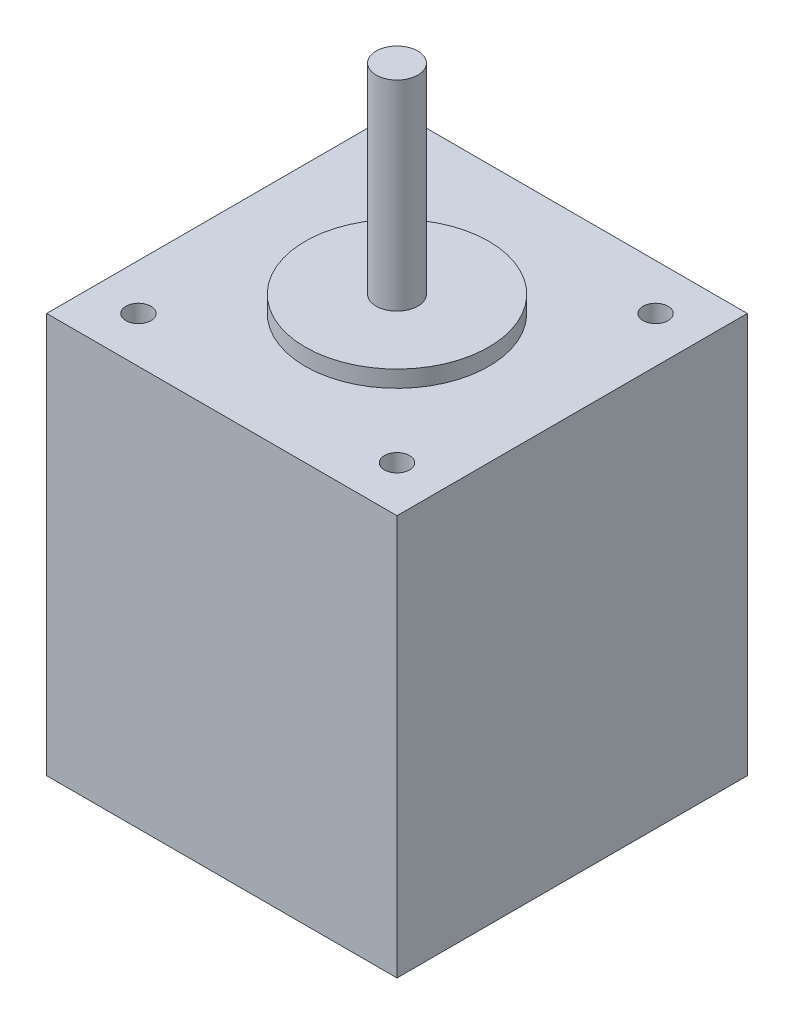
ISO-10303-21;
HEADER;
FILE_DESCRIPTION(('STEP AP214'),'2;1');
FILE_NAME('part.step','',(''),(''),'','','');
FILE_SCHEMA(('AUTOMOTIVE_DESIGN { 1 0 10303 214 1 1 1 1 }'));
ENDSEC;
DATA;
#1=APPLICATION_CONTEXT('core data for automotive mechanical design processes');
#2=APPLICATION_PROTOCOL_DEFINITION('international standard','automotive_design',2000,#1);
#3=PRODUCT_CONTEXT('',#1,'mechanical');
#4=PRODUCT('Part','Part','',(#3));
#5=PRODUCT_RELATED_PRODUCT_CATEGORY('part','',(#4));
#6=PRODUCT_DEFINITION_FORMATION('','',#4);
#7=PRODUCT_DEFINITION_CONTEXT('part definition',#1,'design');
#8=PRODUCT_DEFINITION('design','',#6,#7);
#9=PRODUCT_DEFINITION_SHAPE('','',#8);
#10=(LENGTH_UNIT() NAMED_UNIT(*) SI_UNIT(.MILLI.,.METRE.));
#11=(NAMED_UNIT(*) PLANE_ANGLE_UNIT() SI_UNIT($,.RADIAN.));
#12=(NAMED_UNIT(*) SI_UNIT($,.STERADIAN.) SOLID_ANGLE_UNIT());
#13=UNCERTAINTY_MEASURE_WITH_UNIT(LENGTH_MEASURE(1.E-05),#10,'distance_accuracy_value','');
#14=(GEOMETRIC_REPRESENTATION_CONTEXT(3) GLOBAL_UNCERTAINTY_ASSIGNED_CONTEXT((#13)) GLOBAL_UNIT_ASSIGNED_CONTEXT((#10,
#11,#12)) REPRESENTATION_CONTEXT('',''));
#15=CARTESIAN_POINT('',(0.,0.,0.));
#16=DIRECTION('',(0.,0.,1.));
#17=DIRECTION('',(1.,0.,0.));
#18=AXIS2_PLACEMENT_3D('',#15,#16,#17);
#19=CARTESIAN_POINT('',(0.,48.,0.));
#20=DIRECTION('',(1.,0.,0.));
#21=DIRECTION('',(0.,0.,-1.));
#22=AXIS2_PLACEMENT_3D('',#19,#20,#21);
#23=PLANE('',#22);
#24=DIRECTION('',(0.,0.,1.));
#25=VECTOR('',#24,1.);
#26=CARTESIAN_POINT('',(0.,0.,0.));
#27=LINE('',#26,#25);
#28=CARTESIAN_POINT('',(0.,0.,-42.));
#29=VERTEX_POINT('',#28);
#30=CARTESIAN_POINT('',(0.,0.,0.));
#31=VERTEX_POINT('',#30);
#32=EDGE_CURVE('E99',#29,#31,#27,.T.);
#33=ORIENTED_EDGE('',*,*,#32,.T.);
#34=DIRECTION('',(0.,-1.,0.));
#35=VECTOR('',#34,1.);
#36=CARTESIAN_POINT('',(0.,48.,0.));
#37=LINE('',#36,#35);
#38=CARTESIAN_POINT('',(0.,48.,0.));
#39=VERTEX_POINT('',#38);
#40=EDGE_CURVE('E35',#39,#31,#37,.T.);
#41=ORIENTED_EDGE('',*,*,#40,.F.);
#42=DIRECTION('',(0.,0.,1.));
#43=VECTOR('',#42,1.);
#44=CARTESIAN_POINT('',(0.,48.,0.));
#45=LINE('',#44,#43);
#46=CARTESIAN_POINT('',(0.,48.,-42.));
#47=VERTEX_POINT('',#46);
#48=EDGE_CURVE('E86',#47,#39,#45,.T.);
#49=ORIENTED_EDGE('',*,*,#48,.F.);
#50=DIRECTION('',(0.,-1.,0.));
#51=VECTOR('',#50,1.);
#52=CARTESIAN_POINT('',(0.,48.,-42.));
#53=LINE('',#52,#51);
#54=EDGE_CURVE('E95',#47,#29,#53,.T.);
#55=ORIENTED_EDGE('',*,*,#54,.T.);
#56=EDGE_LOOP('',(#33,#41,#49,#55));
#57=FACE_BOUND('',#56,.T.);
#58=ADVANCED_FACE('F32',(#57),#23,.F.);
#59=CARTESIAN_POINT('',(0.,48.,0.));
#60=DIRECTION('',(0.,0.,-1.));
#61=DIRECTION('',(-1.,0.,0.));
#62=AXIS2_PLACEMENT_3D('',#59,#60,#61);
#63=PLANE('',#62);
#64=DIRECTION('',(1.,0.,0.));
#65=VECTOR('',#64,1.);
#66=CARTESIAN_POINT('',(0.,0.,0.));
#67=LINE('',#66,#65);
#68=CARTESIAN_POINT('',(42.,0.,0.));
#69=VERTEX_POINT('',#68);
#70=EDGE_CURVE('E91',#31,#69,#67,.T.);
#71=ORIENTED_EDGE('',*,*,#70,.T.);
#72=DIRECTION('',(0.,-1.,0.));
#73=VECTOR('',#72,1.);
#74=CARTESIAN_POINT('',(42.,48.,0.));
#75=LINE('',#74,#73);
#76=CARTESIAN_POINT('',(42.,48.,0.));
#77=VERTEX_POINT('',#76);
#78=EDGE_CURVE('E89',#77,#69,#75,.T.);
#79=ORIENTED_EDGE('',*,*,#78,.F.);
#80=DIRECTION('',(1.,0.,0.));
#81=VECTOR('',#80,1.);
#82=CARTESIAN_POINT('',(0.,48.,0.));
#83=LINE('',#82,#81);
#84=EDGE_CURVE('E81',#39,#77,#83,.T.);
#85=ORIENTED_EDGE('',*,*,#84,.F.);
#86=ORIENTED_EDGE('',*,*,#40,.T.);
#87=EDGE_LOOP('',(#71,#79,#85,#86));
#88=FACE_BOUND('',#87,.T.);
#89=ADVANCED_FACE('F90',(#88),#63,.F.);
#90=CARTESIAN_POINT('',(42.,48.,0.));
#91=DIRECTION('',(-1.,0.,0.));
#92=DIRECTION('',(0.,0.,1.));
#93=AXIS2_PLACEMENT_3D('',#90,#91,#92);
#94=PLANE('',#93);
#95=DIRECTION('',(0.,0.,-1.));
#96=VECTOR('',#95,1.);
#97=CARTESIAN_POINT('',(42.,0.,0.));
#98=LINE('',#97,#96);
#99=CARTESIAN_POINT('',(42.,0.,-42.));
#100=VERTEX_POINT('',#99);
#101=EDGE_CURVE('E67',#69,#100,#98,.T.);
#102=ORIENTED_EDGE('',*,*,#101,.T.);
#103=DIRECTION('',(0.,-1.,0.));
#104=VECTOR('',#103,1.);
#105=CARTESIAN_POINT('',(42.,48.,-42.));
#106=LINE('',#105,#104);
#107=CARTESIAN_POINT('',(42.,48.,-42.));
#108=VERTEX_POINT('',#107);
#109=EDGE_CURVE('E92',#108,#100,#106,.T.);
#110=ORIENTED_EDGE('',*,*,#109,.F.);
#111=DIRECTION('',(0.,0.,-1.));
#112=VECTOR('',#111,1.);
#113=CARTESIAN_POINT('',(42.,48.,0.));
#114=LINE('',#113,#112);
#115=EDGE_CURVE('E84',#77,#108,#114,.T.);
#116=ORIENTED_EDGE('',*,*,#115,.F.);
#117=ORIENTED_EDGE('',*,*,#78,.T.);
#118=EDGE_LOOP('',(#102,#110,#116,#117));
#119=FACE_BOUND('',#118,.T.);
#120=ADVANCED_FACE('F93',(#119),#94,.F.);
#121=CARTESIAN_POINT('',(0.,48.,-42.));
#122=DIRECTION('',(0.,0.,1.));
#123=DIRECTION('',(1.,0.,0.));
#124=AXIS2_PLACEMENT_3D('',#121,#122,#123);
#125=PLANE('',#124);
#126=DIRECTION('',(-1.,0.,0.));
#127=VECTOR('',#126,1.);
#128=CARTESIAN_POINT('',(0.,0.,-42.));
#129=LINE('',#128,#127);
#130=EDGE_CURVE('E73',#100,#29,#129,.T.);
#131=ORIENTED_EDGE('',*,*,#130,.T.);
#132=ORIENTED_EDGE('',*,*,#54,.F.);
#133=DIRECTION('',(-1.,0.,0.));
#134=VECTOR('',#133,1.);
#135=CARTESIAN_POINT('',(0.,48.,-42.));
#136=LINE('',#135,#134);
#137=EDGE_CURVE('E50',#108,#47,#136,.T.);
#138=ORIENTED_EDGE('',*,*,#137,.F.);
#139=ORIENTED_EDGE('',*,*,#109,.T.);
#140=EDGE_LOOP('',(#131,#132,#138,#139));
#141=FACE_BOUND('',#140,.T.);
#142=ADVANCED_FACE('F107',(#141),#125,.F.);
#143=CARTESIAN_POINT('',(0.,48.,0.));
#144=DIRECTION('',(0.,-1.,0.));
#145=DIRECTION('',(0.,0.,-1.));
#146=AXIS2_PLACEMENT_3D('',#143,#144,#145);
#147=PLANE('',#146);
#148=CARTESIAN_POINT('',(36.5,48.,-36.5));
#149=DIRECTION('',(0.,1.,0.));
#150=DIRECTION('',(0.,0.,-1.));
#151=AXIS2_PLACEMENT_3D('',#148,#149,#150);
#152=CIRCLE('',#151,1.5);
#153=CARTESIAN_POINT('',(36.5,48.,-38.));
#154=VERTEX_POINT('',#153);
#155=EDGE_CURVE('E134',#154,#154,#152,.T.);
#156=ORIENTED_EDGE('',*,*,#155,.F.);
#157=EDGE_LOOP('',(#156));
#158=FACE_BOUND('',#157,.T.);
#159=CARTESIAN_POINT('',(5.49999999999998,48.,-5.50000000000004));
#160=DIRECTION('',(0.,1.,0.));
#161=DIRECTION('',(0.,0.,-1.));
#162=AXIS2_PLACEMENT_3D('',#159,#160,#161);
#163=CIRCLE('',#162,1.5);
#164=CARTESIAN_POINT('',(5.49999999999998,48.,-7.00000000000005));
#165=VERTEX_POINT('',#164);
#166=EDGE_CURVE('E127',#165,#165,#163,.T.);
#167=ORIENTED_EDGE('',*,*,#166,.F.);
#168=EDGE_LOOP('',(#167));
#169=FACE_BOUND('',#168,.T.);
#170=CARTESIAN_POINT('',(5.49999999999999,48.,-36.5));
#171=DIRECTION('',(0.,1.,0.));
#172=DIRECTION('',(0.,0.,1.));
#173=AXIS2_PLACEMENT_3D('',#170,#171,#172);
#174=CIRCLE('',#173,1.50000000000001);
#175=CARTESIAN_POINT('',(5.49999999999999,48.,-35.));
#176=VERTEX_POINT('',#175);
#177=EDGE_CURVE('E139',#176,#176,#174,.T.);
#178=ORIENTED_EDGE('',*,*,#177,.F.);
#179=EDGE_LOOP('',(#178));
#180=FACE_BOUND('',#179,.T.);
#181=CARTESIAN_POINT('',(36.5,48.,-5.5));
#182=DIRECTION('',(0.,1.,0.));
#183=DIRECTION('',(0.,0.,1.));
#184=AXIS2_PLACEMENT_3D('',#181,#182,#183);
#185=CIRCLE('',#184,1.5);
#186=CARTESIAN_POINT('',(36.5,48.,-4.));
#187=VERTEX_POINT('',#186);
#188=EDGE_CURVE('E121',#187,#187,#185,.T.);
#189=ORIENTED_EDGE('',*,*,#188,.F.);
#190=EDGE_LOOP('',(#189));
#191=FACE_BOUND('',#190,.T.);
#192=CARTESIAN_POINT('',(21.,48.,-21.));
#193=DIRECTION('',(0.,1.,0.));
#194=DIRECTION('',(0.,0.,1.));
#195=AXIS2_PLACEMENT_3D('',#192,#193,#194);
#196=CIRCLE('',#195,11.);
#197=CARTESIAN_POINT('',(21.,48.,-10.));
#198=VERTEX_POINT('',#197);
#199=EDGE_CURVE('E41',#198,#198,#196,.T.);
#200=ORIENTED_EDGE('',*,*,#199,.F.);
#201=EDGE_LOOP('',(#200));
#202=FACE_BOUND('',#201,.T.);
#203=ORIENTED_EDGE('',*,*,#48,.T.);
#204=ORIENTED_EDGE('',*,*,#84,.T.);
#205=ORIENTED_EDGE('',*,*,#115,.T.);
#206=ORIENTED_EDGE('',*,*,#137,.T.);
#207=EDGE_LOOP('',(#203,#204,#205,#206));
#208=FACE_BOUND('',#207,.T.);
#209=ADVANCED_FACE('F82',(#158,#169,#180,#191,#202,#208),#147,.F.);
#210=CARTESIAN_POINT('',(0.,0.,0.));
#211=DIRECTION('',(0.,-1.,0.));
#212=DIRECTION('',(0.,0.,-1.));
#213=AXIS2_PLACEMENT_3D('',#210,#211,#212);
#214=PLANE('',#213);
#215=ORIENTED_EDGE('',*,*,#32,.F.);
#216=ORIENTED_EDGE('',*,*,#130,.F.);
#217=ORIENTED_EDGE('',*,*,#101,.F.);
#218=ORIENTED_EDGE('',*,*,#70,.F.);
#219=EDGE_LOOP('',(#215,#216,#217,#218));
#220=FACE_BOUND('',#219,.T.);
#221=ADVANCED_FACE('F110',(#220),#214,.T.);
#222=CARTESIAN_POINT('',(21.,50.,-21.));
#223=DIRECTION('',(0.,-1.,0.));
#224=DIRECTION('',(0.,0.,-1.));
#225=AXIS2_PLACEMENT_3D('',#222,#223,#224);
#226=CYLINDRICAL_SURFACE('',#225,11.);
#227=CARTESIAN_POINT('',(21.,50.,-21.));
#228=DIRECTION('',(0.,1.,0.));
#229=DIRECTION('',(0.,0.,1.));
#230=AXIS2_PLACEMENT_3D('',#227,#228,#229);
#231=CIRCLE('',#230,11.);
#232=CARTESIAN_POINT('',(21.,50.,-10.));
#233=VERTEX_POINT('',#232);
#234=EDGE_CURVE('E102',#233,#233,#231,.T.);
#235=ORIENTED_EDGE('',*,*,#234,.F.);
#236=EDGE_LOOP('',(#235));
#237=FACE_BOUND('',#236,.T.);
#238=ORIENTED_EDGE('',*,*,#199,.T.);
#239=EDGE_LOOP('',(#238));
#240=FACE_BOUND('',#239,.T.);
#241=ADVANCED_FACE('F162',(#237,#240),#226,.T.);
#242=CARTESIAN_POINT('',(21.,50.,-21.));
#243=DIRECTION('',(0.,1.,0.));
#244=DIRECTION('',(0.,0.,1.));
#245=AXIS2_PLACEMENT_3D('',#242,#243,#244);
#246=PLANE('',#245);
#247=CARTESIAN_POINT('',(21.,50.,-21.));
#248=DIRECTION('',(0.,1.,0.));
#249=DIRECTION('',(0.,0.,1.));
#250=AXIS2_PLACEMENT_3D('',#247,#248,#249);
#251=CIRCLE('',#250,2.5);
#252=CARTESIAN_POINT('',(21.,50.,-18.5));
#253=VERTEX_POINT('',#252);
#254=EDGE_CURVE('E11',#253,#253,#251,.T.);
#255=ORIENTED_EDGE('',*,*,#254,.F.);
#256=EDGE_LOOP('',(#255));
#257=FACE_BOUND('',#256,.T.);
#258=ORIENTED_EDGE('',*,*,#234,.T.);
#259=EDGE_LOOP('',(#258));
#260=FACE_BOUND('',#259,.T.);
#261=ADVANCED_FACE('F164',(#257,#260),#246,.T.);
#262=CARTESIAN_POINT('',(21.,74.,-21.));
#263=DIRECTION('',(0.,-1.,0.));
#264=DIRECTION('',(0.,0.,-1.));
#265=AXIS2_PLACEMENT_3D('',#262,#263,#264);
#266=CYLINDRICAL_SURFACE('',#265,2.5);
#267=CARTESIAN_POINT('',(21.,74.,-21.));
#268=DIRECTION('',(0.,1.,0.));
#269=DIRECTION('',(0.,0.,1.));
#270=AXIS2_PLACEMENT_3D('',#267,#268,#269);
#271=CIRCLE('',#270,2.5);
#272=CARTESIAN_POINT('',(21.,74.,-18.5));
#273=VERTEX_POINT('',#272);
#274=EDGE_CURVE('E116',#273,#273,#271,.T.);
#275=ORIENTED_EDGE('',*,*,#274,.F.);
#276=EDGE_LOOP('',(#275));
#277=FACE_BOUND('',#276,.T.);
#278=ORIENTED_EDGE('',*,*,#254,.T.);
#279=EDGE_LOOP('',(#278));
#280=FACE_BOUND('',#279,.T.);
#281=ADVANCED_FACE('F171',(#277,#280),#266,.T.);
#282=CARTESIAN_POINT('',(21.,74.,-21.));
#283=DIRECTION('',(0.,1.,0.));
#284=DIRECTION('',(0.,0.,1.));
#285=AXIS2_PLACEMENT_3D('',#282,#283,#284);
#286=PLANE('',#285);
#287=ORIENTED_EDGE('',*,*,#274,.T.);
#288=EDGE_LOOP('',(#287));
#289=FACE_BOUND('',#288,.T.);
#290=ADVANCED_FACE('F218',(#289),#286,.T.);
#291=CARTESIAN_POINT('',(36.5,43.5,-5.5));
#292=DIRECTION('',(0.,1.,0.));
#293=DIRECTION('',(0.,0.,1.));
#294=AXIS2_PLACEMENT_3D('',#291,#292,#293);
#295=CYLINDRICAL_SURFACE('',#294,1.5);
#296=CARTESIAN_POINT('',(36.5,43.5,-5.5));
#297=DIRECTION('',(0.,1.,0.));
#298=DIRECTION('',(0.,0.,1.));
#299=AXIS2_PLACEMENT_3D('',#296,#297,#298);
#300=CIRCLE('',#299,1.5);
#301=CARTESIAN_POINT('',(36.5,43.5,-4.));
#302=VERTEX_POINT('',#301);
#303=EDGE_CURVE('E120',#302,#302,#300,.T.);
#304=ORIENTED_EDGE('',*,*,#303,.F.);
#305=EDGE_LOOP('',(#304));
#306=FACE_BOUND('',#305,.T.);
#307=ORIENTED_EDGE('',*,*,#188,.T.);
#308=EDGE_LOOP('',(#307));
#309=FACE_BOUND('',#308,.T.);
#310=ADVANCED_FACE('F227',(#306,#309),#295,.F.);
#311=CARTESIAN_POINT('',(36.5,43.5,-5.5));
#312=DIRECTION('',(0.,1.,0.));
#313=DIRECTION('',(0.,0.,1.));
#314=AXIS2_PLACEMENT_3D('',#311,#312,#313);
#315=PLANE('',#314);
#316=ORIENTED_EDGE('',*,*,#303,.T.);
#317=EDGE_LOOP('',(#316));
#318=FACE_BOUND('',#317,.T.);
#319=ADVANCED_FACE('F150',(#318),#315,.T.);
#320=CARTESIAN_POINT('',(5.49999999999999,43.5,-36.5));
#321=DIRECTION('',(0.,1.,0.));
#322=DIRECTION('',(0.,0.,1.));
#323=AXIS2_PLACEMENT_3D('',#320,#321,#322);
#324=CYLINDRICAL_SURFACE('',#323,1.50000000000001);
#325=CARTESIAN_POINT('',(5.49999999999999,43.5,-36.5));
#326=DIRECTION('',(0.,1.,0.));
#327=DIRECTION('',(0.,0.,1.));
#328=AXIS2_PLACEMENT_3D('',#325,#326,#327);
#329=CIRCLE('',#328,1.50000000000001);
#330=CARTESIAN_POINT('',(5.49999999999999,43.5,-35.));
#331=VERTEX_POINT('',#330);
#332=EDGE_CURVE('E131',#331,#331,#329,.T.);
#333=ORIENTED_EDGE('',*,*,#332,.F.);
#334=EDGE_LOOP('',(#333));
#335=FACE_BOUND('',#334,.T.);
#336=ORIENTED_EDGE('',*,*,#177,.T.);
#337=EDGE_LOOP('',(#336));
#338=FACE_BOUND('',#337,.T.);
#339=ADVANCED_FACE('F147',(#335,#338),#324,.F.);
#340=CARTESIAN_POINT('',(5.49999999999999,43.5,-36.5));
#341=DIRECTION('',(0.,1.,0.));
#342=DIRECTION('',(0.,0.,1.));
#343=AXIS2_PLACEMENT_3D('',#340,#341,#342);
#344=PLANE('',#343);
#345=ORIENTED_EDGE('',*,*,#332,.T.);
#346=EDGE_LOOP('',(#345));
#347=FACE_BOUND('',#346,.T.);
#348=ADVANCED_FACE('F145',(#347),#344,.T.);
#349=CARTESIAN_POINT('',(5.49999999999998,43.5,-5.50000000000004));
#350=DIRECTION('',(0.,1.,0.));
#351=DIRECTION('',(0.,0.,1.));
#352=AXIS2_PLACEMENT_3D('',#349,#350,#351);
#353=CYLINDRICAL_SURFACE('',#352,1.5);
#354=CARTESIAN_POINT('',(5.49999999999998,43.5,-5.50000000000004));
#355=DIRECTION('',(0.,1.,0.));
#356=DIRECTION('',(0.,0.,-1.));
#357=AXIS2_PLACEMENT_3D('',#354,#355,#356);
#358=CIRCLE('',#357,1.5);
#359=CARTESIAN_POINT('',(5.49999999999998,43.5,-7.00000000000005));
#360=VERTEX_POINT('',#359);
#361=EDGE_CURVE('E130',#360,#360,#358,.T.);
#362=ORIENTED_EDGE('',*,*,#361,.F.);
#363=EDGE_LOOP('',(#362));
#364=FACE_BOUND('',#363,.T.);
#365=ORIENTED_EDGE('',*,*,#166,.T.);
#366=EDGE_LOOP('',(#365));
#367=FACE_BOUND('',#366,.T.);
#368=ADVANCED_FACE('F254',(#364,#367),#353,.F.);
#369=CARTESIAN_POINT('',(5.49999999999998,43.5,-5.50000000000004));
#370=DIRECTION('',(0.,-1.,0.));
#371=DIRECTION('',(0.,0.,-1.));
#372=AXIS2_PLACEMENT_3D('',#369,#370,#371);
#373=PLANE('',#372);
#374=ORIENTED_EDGE('',*,*,#361,.T.);
#375=EDGE_LOOP('',(#374));
#376=FACE_BOUND('',#375,.T.);
#377=ADVANCED_FACE('F261',(#376),#373,.F.);
#378=CARTESIAN_POINT('',(36.5,43.5,-36.5));
#379=DIRECTION('',(0.,1.,0.));
#380=DIRECTION('',(0.,0.,1.));
#381=AXIS2_PLACEMENT_3D('',#378,#379,#380);
#382=CYLINDRICAL_SURFACE('',#381,1.5);
#383=CARTESIAN_POINT('',(36.5,43.5,-36.5));
#384=DIRECTION('',(0.,1.,0.));
#385=DIRECTION('',(0.,0.,-1.));
#386=AXIS2_PLACEMENT_3D('',#383,#384,#385);
#387=CIRCLE('',#386,1.5);
#388=CARTESIAN_POINT('',(36.5,43.5,-38.));
#389=VERTEX_POINT('',#388);
#390=EDGE_CURVE('E124',#389,#389,#387,.T.);
#391=ORIENTED_EDGE('',*,*,#390,.F.);
#392=EDGE_LOOP('',(#391));
#393=FACE_BOUND('',#392,.T.);
#394=ORIENTED_EDGE('',*,*,#155,.T.);
#395=EDGE_LOOP('',(#394));
#396=FACE_BOUND('',#395,.T.);
#397=ADVANCED_FACE('F269',(#393,#396),#382,.F.);
#398=CARTESIAN_POINT('',(36.5,43.5,-36.5));
#399=DIRECTION('',(0.,-1.,0.));
#400=DIRECTION('',(0.,0.,-1.));
#401=AXIS2_PLACEMENT_3D('',#398,#399,#400);
#402=PLANE('',#401);
#403=ORIENTED_EDGE('',*,*,#390,.T.);
#404=EDGE_LOOP('',(#403));
#405=FACE_BOUND('',#404,.T.);
#406=ADVANCED_FACE('F277',(#405),#402,.F.);
#407=CLOSED_SHELL('',(#58,#89,#120,#142,#209,#221,#241,#261,#281,#290,#310,#319,#339,#348,#368,
#377,#397,#406));
#408=MANIFOLD_SOLID_BREP('B2',#407);
#409=ADVANCED_BREP_SHAPE_REPRESENTATION('',(#18,#408),#14);
#410=SHAPE_DEFINITION_REPRESENTATION(#9,#409);
ENDSEC;
END-ISO-10303-21;
